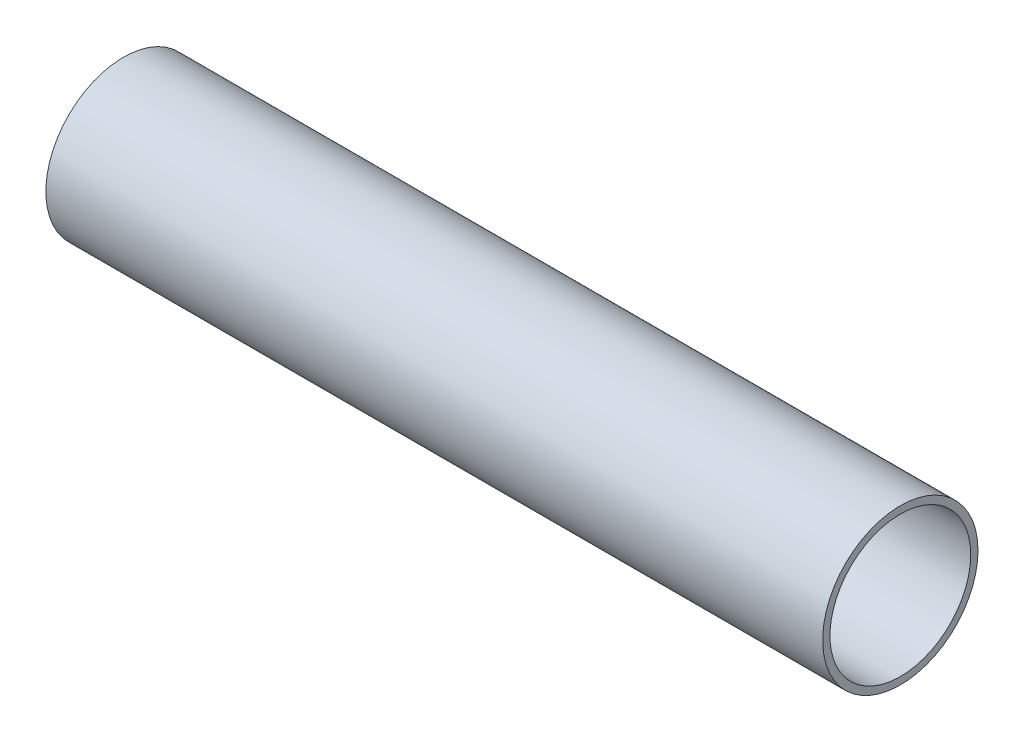
ISO-10303-21;
HEADER;
FILE_DESCRIPTION(('STEP AP214'),'2;1');
FILE_NAME('part.step','',(''),(''),'','','');
FILE_SCHEMA(('AUTOMOTIVE_DESIGN { 1 0 10303 214 1 1 1 1 }'));
ENDSEC;
DATA;
#1=APPLICATION_CONTEXT('core data for automotive mechanical design processes');
#2=APPLICATION_PROTOCOL_DEFINITION('international standard','automotive_design',2000,#1);
#3=PRODUCT_CONTEXT('',#1,'mechanical');
#4=PRODUCT('Part','Part','',(#3));
#5=PRODUCT_RELATED_PRODUCT_CATEGORY('part','',(#4));
#6=PRODUCT_DEFINITION_FORMATION('','',#4);
#7=PRODUCT_DEFINITION_CONTEXT('part definition',#1,'design');
#8=PRODUCT_DEFINITION('design','',#6,#7);
#9=PRODUCT_DEFINITION_SHAPE('','',#8);
#10=(LENGTH_UNIT() NAMED_UNIT(*) SI_UNIT(.MILLI.,.METRE.));
#11=(NAMED_UNIT(*) PLANE_ANGLE_UNIT() SI_UNIT($,.RADIAN.));
#12=(NAMED_UNIT(*) SI_UNIT($,.STERADIAN.) SOLID_ANGLE_UNIT());
#13=UNCERTAINTY_MEASURE_WITH_UNIT(LENGTH_MEASURE(1.E-05),#10,'distance_accuracy_value','');
#14=(GEOMETRIC_REPRESENTATION_CONTEXT(3) GLOBAL_UNCERTAINTY_ASSIGNED_CONTEXT((#13)) GLOBAL_UNIT_ASSIGNED_CONTEXT((#10,
#11,#12)) REPRESENTATION_CONTEXT('',''));
#15=CARTESIAN_POINT('',(0.,0.,0.));
#16=DIRECTION('',(0.,0.,1.));
#17=DIRECTION('',(1.,0.,0.));
#18=AXIS2_PLACEMENT_3D('',#15,#16,#17);
#19=CARTESIAN_POINT('',(0.,0.,0.));
#20=DIRECTION('',(1.,0.,0.));
#21=DIRECTION('',(0.,0.,-1.));
#22=AXIS2_PLACEMENT_3D('',#19,#20,#21);
#23=CYLINDRICAL_SURFACE('',#22,7.25);
#24=CARTESIAN_POINT('',(80.,0.,0.));
#25=DIRECTION('',(1.,0.,0.));
#26=DIRECTION('',(0.,0.,-1.));
#27=AXIS2_PLACEMENT_3D('',#24,#25,#26);
#28=CIRCLE('',#27,7.25);
#29=CARTESIAN_POINT('',(80.,0.,-7.25));
#30=VERTEX_POINT('',#29);
#31=EDGE_CURVE('E15',#30,#30,#28,.F.);
#32=ORIENTED_EDGE('',*,*,#31,.F.);
#33=EDGE_LOOP('',(#32));
#34=FACE_BOUND('',#33,.T.);
#35=CARTESIAN_POINT('',(0.,0.,0.));
#36=DIRECTION('',(1.,0.,0.));
#37=DIRECTION('',(0.,0.,-1.));
#38=AXIS2_PLACEMENT_3D('',#35,#36,#37);
#39=CIRCLE('',#38,7.25);
#40=CARTESIAN_POINT('',(0.,0.,-7.25));
#41=VERTEX_POINT('',#40);
#42=EDGE_CURVE('E24',#41,#41,#39,.F.);
#43=ORIENTED_EDGE('',*,*,#42,.T.);
#44=EDGE_LOOP('',(#43));
#45=FACE_BOUND('',#44,.T.);
#46=ADVANCED_FACE('F12',(#34,#45),#23,.F.);
#47=CARTESIAN_POINT('',(80.,0.,0.));
#48=DIRECTION('',(1.,0.,0.));
#49=DIRECTION('',(0.,0.,-1.));
#50=AXIS2_PLACEMENT_3D('',#47,#48,#49);
#51=PLANE('',#50);
#52=ORIENTED_EDGE('',*,*,#31,.T.);
#53=EDGE_LOOP('',(#52));
#54=FACE_BOUND('',#53,.T.);
#55=CARTESIAN_POINT('',(80.,0.,0.));
#56=DIRECTION('',(1.,0.,0.));
#57=DIRECTION('',(0.,0.,-1.));
#58=AXIS2_PLACEMENT_3D('',#55,#56,#57);
#59=CIRCLE('',#58,8.);
#60=CARTESIAN_POINT('',(80.,0.,-8.));
#61=VERTEX_POINT('',#60);
#62=EDGE_CURVE('E19',#61,#61,#59,.F.);
#63=ORIENTED_EDGE('',*,*,#62,.F.);
#64=EDGE_LOOP('',(#63));
#65=FACE_BOUND('',#64,.T.);
#66=ADVANCED_FACE('F32',(#54,#65),#51,.T.);
#67=CARTESIAN_POINT('',(0.,0.,0.));
#68=DIRECTION('',(1.,0.,0.));
#69=DIRECTION('',(0.,0.,-1.));
#70=AXIS2_PLACEMENT_3D('',#67,#68,#69);
#71=PLANE('',#70);
#72=ORIENTED_EDGE('',*,*,#42,.F.);
#73=EDGE_LOOP('',(#72));
#74=FACE_BOUND('',#73,.T.);
#75=CARTESIAN_POINT('',(0.,0.,0.));
#76=DIRECTION('',(1.,0.,0.));
#77=DIRECTION('',(0.,0.,-1.));
#78=AXIS2_PLACEMENT_3D('',#75,#76,#77);
#79=CIRCLE('',#78,8.);
#80=CARTESIAN_POINT('',(0.,0.,-8.));
#81=VERTEX_POINT('',#80);
#82=EDGE_CURVE('E8',#81,#81,#79,.T.);
#83=ORIENTED_EDGE('',*,*,#82,.F.);
#84=EDGE_LOOP('',(#83));
#85=FACE_BOUND('',#84,.T.);
#86=ADVANCED_FACE('F40',(#74,#85),#71,.F.);
#87=CARTESIAN_POINT('',(0.,0.,0.));
#88=DIRECTION('',(1.,0.,0.));
#89=DIRECTION('',(0.,0.,-1.));
#90=AXIS2_PLACEMENT_3D('',#87,#88,#89);
#91=CYLINDRICAL_SURFACE('',#90,8.);
#92=ORIENTED_EDGE('',*,*,#62,.T.);
#93=EDGE_LOOP('',(#92));
#94=FACE_BOUND('',#93,.T.);
#95=ORIENTED_EDGE('',*,*,#82,.T.);
#96=EDGE_LOOP('',(#95));
#97=FACE_BOUND('',#96,.T.);
#98=ADVANCED_FACE('F41',(#94,#97),#91,.T.);
#99=CLOSED_SHELL('',(#46,#66,#86,#98));
#100=MANIFOLD_SOLID_BREP('B1',#99);
#101=ADVANCED_BREP_SHAPE_REPRESENTATION('',(#18,#100),#14);
#102=SHAPE_DEFINITION_REPRESENTATION(#9,#101);
ENDSEC;
END-ISO-10303-21;
